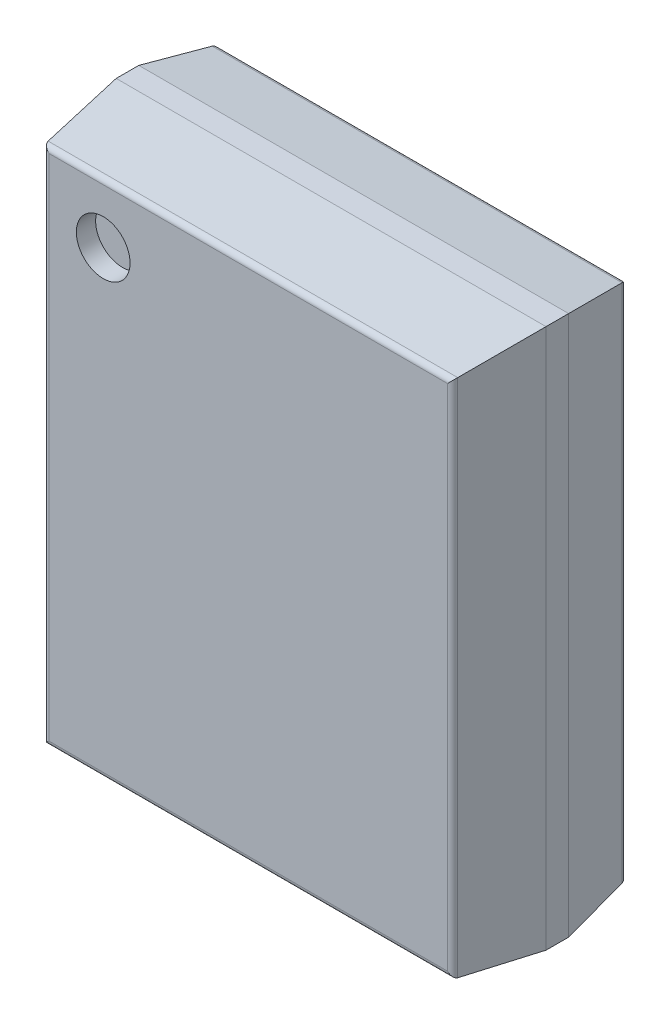
ISO-10303-21;
HEADER;
FILE_DESCRIPTION(('STEP AP214'),'2;1');
FILE_NAME('part.step','',(''),(''),'','','');
FILE_SCHEMA(('AUTOMOTIVE_DESIGN { 1 0 10303 214 1 1 1 1 }'));
ENDSEC;
DATA;
#1=APPLICATION_CONTEXT('core data for automotive mechanical design processes');
#2=APPLICATION_PROTOCOL_DEFINITION('international standard','automotive_design',2000,#1);
#3=PRODUCT_CONTEXT('',#1,'mechanical');
#4=PRODUCT('Part','Part','',(#3));
#5=PRODUCT_RELATED_PRODUCT_CATEGORY('part','',(#4));
#6=PRODUCT_DEFINITION_FORMATION('','',#4);
#7=PRODUCT_DEFINITION_CONTEXT('part definition',#1,'design');
#8=PRODUCT_DEFINITION('design','',#6,#7);
#9=PRODUCT_DEFINITION_SHAPE('','',#8);
#10=(LENGTH_UNIT() NAMED_UNIT(*) SI_UNIT(.MILLI.,.METRE.));
#11=(NAMED_UNIT(*) PLANE_ANGLE_UNIT() SI_UNIT($,.RADIAN.));
#12=(NAMED_UNIT(*) SI_UNIT($,.STERADIAN.) SOLID_ANGLE_UNIT());
#13=UNCERTAINTY_MEASURE_WITH_UNIT(LENGTH_MEASURE(1.E-05),#10,'distance_accuracy_value','');
#14=(GEOMETRIC_REPRESENTATION_CONTEXT(3) GLOBAL_UNCERTAINTY_ASSIGNED_CONTEXT((#13)) GLOBAL_UNIT_ASSIGNED_CONTEXT((#10,
#11,#12)) REPRESENTATION_CONTEXT('',''));
#15=CARTESIAN_POINT('',(0.,0.,0.));
#16=DIRECTION('',(0.,0.,1.));
#17=DIRECTION('',(1.,0.,0.));
#18=AXIS2_PLACEMENT_3D('',#15,#16,#17);
#19=CARTESIAN_POINT('',(-1.315,1.815,1.575));
#20=DIRECTION('',(0.,0.,1.));
#21=DIRECTION('',(1.,0.,0.));
#22=AXIS2_PLACEMENT_3D('',#19,#20,#21);
#23=PLANE('',#22);
#24=CARTESIAN_POINT('',(-1.315,1.815,1.575));
#25=DIRECTION('',(0.,0.,1.));
#26=DIRECTION('',(1.,0.,0.));
#27=AXIS2_PLACEMENT_3D('',#24,#25,#26);
#28=CIRCLE('',#27,0.24375);
#29=CARTESIAN_POINT('',(-1.07125,1.815,1.575));
#30=VERTEX_POINT('',#29);
#31=EDGE_CURVE('E11',#30,#30,#28,.T.);
#32=ORIENTED_EDGE('',*,*,#31,.T.);
#33=EDGE_LOOP('',(#32));
#34=FACE_BOUND('',#33,.T.);
#35=ADVANCED_FACE('F17',(#34),#23,.T.);
#36=CARTESIAN_POINT('',(-1.315,1.815,1.575));
#37=DIRECTION('',(0.,0.,1.));
#38=DIRECTION('',(1.,0.,0.));
#39=AXIS2_PLACEMENT_3D('',#36,#37,#38);
#40=CYLINDRICAL_SURFACE('',#39,0.24375);
#41=DIRECTION('',(0.,0.,1.));
#42=VECTOR('',#41,1.);
#43=CARTESIAN_POINT('',(-1.07125,1.815,1.575));
#44=LINE('',#43,#42);
#45=CARTESIAN_POINT('',(-1.07125,1.815,1.75));
#46=VERTEX_POINT('',#45);
#47=EDGE_CURVE('E25',#30,#46,#44,.T.);
#48=ORIENTED_EDGE('',*,*,#47,.T.);
#49=CARTESIAN_POINT('',(-1.315,1.815,1.75));
#50=DIRECTION('',(0.,0.,1.));
#51=DIRECTION('',(1.,0.,0.));
#52=AXIS2_PLACEMENT_3D('',#49,#50,#51);
#53=CIRCLE('',#52,0.24375);
#54=EDGE_CURVE('E240',#46,#46,#53,.T.);
#55=ORIENTED_EDGE('',*,*,#54,.T.);
#56=ORIENTED_EDGE('',*,*,#47,.F.);
#57=ORIENTED_EDGE('',*,*,#31,.F.);
#58=EDGE_LOOP('',(#48,#55,#56,#57));
#59=FACE_BOUND('',#58,.T.);
#60=ADVANCED_FACE('F405',(#59),#40,.F.);
#61=CARTESIAN_POINT('',(1.808558552786,-2.3525,1.7));
#62=DIRECTION('',(0.,1.,0.));
#63=DIRECTION('',(0.,0.,1.));
#64=AXIS2_PLACEMENT_3D('',#61,#62,#63);
#65=CYLINDRICAL_SURFACE('',#64,0.05);
#66=CARTESIAN_POINT('',(1.808558552786,-2.308558552786,1.7));
#67=DIRECTION('',(-0.707106781186548,-0.707106781186548,0.));
#68=DIRECTION('',(0.707106781186548,-0.707106781186548,0.));
#69=AXIS2_PLACEMENT_3D('',#66,#67,#68);
#70=ELLIPSE('',#69,0.07071067811865,0.05);
#71=CARTESIAN_POINT('',(1.858144342698,-2.358144342698,1.706422572601));
#72=VERTEX_POINT('',#71);
#73=CARTESIAN_POINT('',(1.808558552786,-2.308558552786,1.75));
#74=VERTEX_POINT('',#73);
#75=EDGE_CURVE('E227',#72,#74,#70,.T.);
#76=ORIENTED_EDGE('',*,*,#75,.F.);
#77=DIRECTION('',(0.,1.,0.));
#78=VECTOR('',#77,1.);
#79=CARTESIAN_POINT('',(1.858144342698,-2.3525,1.706422572601));
#80=LINE('',#79,#78);
#81=CARTESIAN_POINT('',(1.858144342698,2.358144342698,1.706422572601));
#82=VERTEX_POINT('',#81);
#83=EDGE_CURVE('E223',#72,#82,#80,.T.);
#84=ORIENTED_EDGE('',*,*,#83,.T.);
#85=CARTESIAN_POINT('',(1.808558552786,2.308558552786,1.7));
#86=DIRECTION('',(-0.707106781186548,0.707106781186548,0.));
#87=DIRECTION('',(0.707106781186548,0.707106781186548,0.));
#88=AXIS2_PLACEMENT_3D('',#85,#86,#87);
#89=ELLIPSE('',#88,0.07071067811865,0.05);
#90=CARTESIAN_POINT('',(1.808558552786,2.308558552786,1.75));
#91=VERTEX_POINT('',#90);
#92=EDGE_CURVE('E214',#91,#82,#89,.T.);
#93=ORIENTED_EDGE('',*,*,#92,.F.);
#94=DIRECTION('',(0.,1.,0.));
#95=VECTOR('',#94,1.);
#96=CARTESIAN_POINT('',(1.808558552786,-2.3525,1.75));
#97=LINE('',#96,#95);
#98=EDGE_CURVE('E228',#74,#91,#97,.T.);
#99=ORIENTED_EDGE('',*,*,#98,.F.);
#100=EDGE_LOOP('',(#76,#84,#93,#99));
#101=FACE_BOUND('',#100,.T.);
#102=ADVANCED_FACE('F252',(#101),#65,.T.);
#103=CARTESIAN_POINT('',(-1.8525,2.308558552786,1.7));
#104=DIRECTION('',(1.,0.,0.));
#105=DIRECTION('',(0.,0.,1.));
#106=AXIS2_PLACEMENT_3D('',#103,#104,#105);
#107=CYLINDRICAL_SURFACE('',#106,0.05);
#108=DIRECTION('',(1.,0.,0.));
#109=VECTOR('',#108,1.);
#110=CARTESIAN_POINT('',(-1.8525,2.308558552786,1.75));
#111=LINE('',#110,#109);
#112=CARTESIAN_POINT('',(-1.808558552786,2.308558552786,1.75));
#113=VERTEX_POINT('',#112);
#114=EDGE_CURVE('E232',#113,#91,#111,.T.);
#115=ORIENTED_EDGE('',*,*,#114,.T.);
#116=ORIENTED_EDGE('',*,*,#92,.T.);
#117=DIRECTION('',(1.,0.,0.));
#118=VECTOR('',#117,1.);
#119=CARTESIAN_POINT('',(-1.8525,2.358144342698,1.706422572601));
#120=LINE('',#119,#118);
#121=CARTESIAN_POINT('',(-1.858144342698,2.358144342698,1.706422572601));
#122=VERTEX_POINT('',#121);
#123=EDGE_CURVE('E218',#122,#82,#120,.T.);
#124=ORIENTED_EDGE('',*,*,#123,.F.);
#125=CARTESIAN_POINT('',(-1.808558552786,2.308558552786,1.7));
#126=DIRECTION('',(0.707106781186548,0.707106781186548,0.));
#127=DIRECTION('',(-0.707106781186548,0.707106781186548,0.));
#128=AXIS2_PLACEMENT_3D('',#125,#126,#127);
#129=ELLIPSE('',#128,0.07071067811865,0.05);
#130=EDGE_CURVE('E211',#122,#113,#129,.T.);
#131=ORIENTED_EDGE('',*,*,#130,.T.);
#132=EDGE_LOOP('',(#115,#116,#124,#131));
#133=FACE_BOUND('',#132,.T.);
#134=ADVANCED_FACE('F247',(#133),#107,.T.);
#135=CARTESIAN_POINT('',(-1.95,-2.45,1.75));
#136=DIRECTION('',(0.,0.,1.));
#137=DIRECTION('',(1.,0.,0.));
#138=AXIS2_PLACEMENT_3D('',#135,#136,#137);
#139=PLANE('',#138);
#140=ORIENTED_EDGE('',*,*,#54,.F.);
#141=EDGE_LOOP('',(#140));
#142=FACE_BOUND('',#141,.T.);
#143=DIRECTION('',(0.,1.,0.));
#144=VECTOR('',#143,1.);
#145=CARTESIAN_POINT('',(-1.808558552786,-2.3525,1.75));
#146=LINE('',#145,#144);
#147=CARTESIAN_POINT('',(-1.808558552786,-2.308558552786,1.75));
#148=VERTEX_POINT('',#147);
#149=EDGE_CURVE('E207',#148,#113,#146,.T.);
#150=ORIENTED_EDGE('',*,*,#149,.F.);
#151=DIRECTION('',(1.,0.,0.));
#152=VECTOR('',#151,1.);
#153=CARTESIAN_POINT('',(-1.8525,-2.308558552786,1.75));
#154=LINE('',#153,#152);
#155=EDGE_CURVE('E233',#148,#74,#154,.T.);
#156=ORIENTED_EDGE('',*,*,#155,.T.);
#157=ORIENTED_EDGE('',*,*,#98,.T.);
#158=ORIENTED_EDGE('',*,*,#114,.F.);
#159=EDGE_LOOP('',(#150,#156,#157,#158));
#160=FACE_BOUND('',#159,.T.);
#161=ADVANCED_FACE('F274',(#142,#160),#139,.T.);
#162=CARTESIAN_POINT('',(-1.8525,-2.308558552786,1.7));
#163=DIRECTION('',(1.,0.,0.));
#164=DIRECTION('',(0.,-0.991715798237691,0.12845145201896));
#165=AXIS2_PLACEMENT_3D('',#162,#163,#164);
#166=CYLINDRICAL_SURFACE('',#165,0.05);
#167=DIRECTION('',(1.,0.,0.));
#168=VECTOR('',#167,1.);
#169=CARTESIAN_POINT('',(-1.8525,-2.358144342698,1.706422572601));
#170=LINE('',#169,#168);
#171=CARTESIAN_POINT('',(-1.858144342698,-2.358144342698,1.706422572601));
#172=VERTEX_POINT('',#171);
#173=EDGE_CURVE('E199',#172,#72,#170,.T.);
#174=ORIENTED_EDGE('',*,*,#173,.T.);
#175=ORIENTED_EDGE('',*,*,#75,.T.);
#176=ORIENTED_EDGE('',*,*,#155,.F.);
#177=CARTESIAN_POINT('',(-1.808558552786,-2.308558552786,1.7));
#178=DIRECTION('',(-0.707106781186548,0.707106781186548,0.));
#179=DIRECTION('',(0.707106781186548,0.707106781186548,0.));
#180=AXIS2_PLACEMENT_3D('',#177,#178,#179);
#181=ELLIPSE('',#180,0.07071067811865,0.05);
#182=EDGE_CURVE('E203',#172,#148,#181,.T.);
#183=ORIENTED_EDGE('',*,*,#182,.F.);
#184=EDGE_LOOP('',(#174,#175,#176,#183));
#185=FACE_BOUND('',#184,.T.);
#186=ADVANCED_FACE('F391',(#185),#166,.T.);
#187=CARTESIAN_POINT('',(1.90125,-2.45,1.373623210137));
#188=DIRECTION('',(0.991715798237691,0.,0.12845145201896));
#189=DIRECTION('',(0.,-1.,0.));
#190=AXIS2_PLACEMENT_3D('',#187,#188,#189);
#191=PLANE('',#190);
#192=DIRECTION('',(-0.12740467794397,0.12740467794397,0.983634127140771));
#193=VECTOR('',#192,1.);
#194=CARTESIAN_POINT('',(1.870389001332,-2.370389001332,1.611887079072));
#195=LINE('',#194,#193);
#196=CARTESIAN_POINT('',(1.95,-2.45,0.997246420274));
#197=VERTEX_POINT('',#196);
#198=EDGE_CURVE('E195',#197,#72,#195,.T.);
#199=ORIENTED_EDGE('',*,*,#198,.F.);
#200=DIRECTION('',(0.,1.,0.));
#201=VECTOR('',#200,1.);
#202=CARTESIAN_POINT('',(1.95,-2.45,0.997246420274));
#203=LINE('',#202,#201);
#204=CARTESIAN_POINT('',(1.95,2.45,0.997246420274));
#205=VERTEX_POINT('',#204);
#206=EDGE_CURVE('E191',#197,#205,#203,.T.);
#207=ORIENTED_EDGE('',*,*,#206,.T.);
#208=DIRECTION('',(-0.12740467794397,-0.12740467794397,0.983634127140771));
#209=VECTOR('',#208,1.);
#210=CARTESIAN_POINT('',(1.830620719025,2.330620719025,1.91892007257));
#211=LINE('',#210,#209);
#212=EDGE_CURVE('E222',#205,#82,#211,.T.);
#213=ORIENTED_EDGE('',*,*,#212,.T.);
#214=ORIENTED_EDGE('',*,*,#83,.F.);
#215=EDGE_LOOP('',(#199,#207,#213,#214));
#216=FACE_BOUND('',#215,.T.);
#217=ADVANCED_FACE('F254',(#216),#191,.T.);
#218=CARTESIAN_POINT('',(-1.95,2.40125,1.373623210137));
#219=DIRECTION('',(0.,0.991715798237691,0.12845145201896));
#220=DIRECTION('',(1.,0.,0.));
#221=AXIS2_PLACEMENT_3D('',#218,#219,#220);
#222=PLANE('',#221);
#223=ORIENTED_EDGE('',*,*,#123,.T.);
#224=ORIENTED_EDGE('',*,*,#212,.F.);
#225=DIRECTION('',(1.,0.,0.));
#226=VECTOR('',#225,1.);
#227=CARTESIAN_POINT('',(-1.95,2.45,0.997246420274));
#228=LINE('',#227,#226);
#229=CARTESIAN_POINT('',(-1.95,2.45,0.997246420274));
#230=VERTEX_POINT('',#229);
#231=EDGE_CURVE('E186',#230,#205,#228,.T.);
#232=ORIENTED_EDGE('',*,*,#231,.F.);
#233=DIRECTION('',(0.12740467794397,-0.12740467794397,0.983634127140771));
#234=VECTOR('',#233,1.);
#235=CARTESIAN_POINT('',(-1.862273025351,2.362273025351,1.674546873663));
#236=LINE('',#235,#234);
#237=EDGE_CURVE('E181',#230,#122,#236,.T.);
#238=ORIENTED_EDGE('',*,*,#237,.T.);
#239=EDGE_LOOP('',(#223,#224,#232,#238));
#240=FACE_BOUND('',#239,.T.);
#241=ADVANCED_FACE('F260',(#240),#222,.T.);
#242=CARTESIAN_POINT('',(-1.808558552786,-2.3525,1.7));
#243=DIRECTION('',(0.,1.,0.));
#244=DIRECTION('',(-0.991715798237691,0.,0.12845145201896));
#245=AXIS2_PLACEMENT_3D('',#242,#243,#244);
#246=CYLINDRICAL_SURFACE('',#245,0.05);
#247=ORIENTED_EDGE('',*,*,#182,.T.);
#248=ORIENTED_EDGE('',*,*,#149,.T.);
#249=ORIENTED_EDGE('',*,*,#130,.F.);
#250=DIRECTION('',(0.,1.,0.));
#251=VECTOR('',#250,1.);
#252=CARTESIAN_POINT('',(-1.858144342698,-2.3525,1.706422572601));
#253=LINE('',#252,#251);
#254=EDGE_CURVE('E151',#172,#122,#253,.T.);
#255=ORIENTED_EDGE('',*,*,#254,.F.);
#256=EDGE_LOOP('',(#247,#248,#249,#255));
#257=FACE_BOUND('',#256,.T.);
#258=ADVANCED_FACE('F271',(#257),#246,.T.);
#259=CARTESIAN_POINT('',(-1.95,-2.40125,1.373623210137));
#260=DIRECTION('',(0.,0.991715798237691,-0.12845145201896));
#261=DIRECTION('',(-1.,0.,0.));
#262=AXIS2_PLACEMENT_3D('',#259,#260,#261);
#263=PLANE('',#262);
#264=DIRECTION('',(0.12740467794397,0.12740467794397,0.983634127140771));
#265=VECTOR('',#264,1.);
#266=CARTESIAN_POINT('',(-1.902041307658,-2.402041307658,1.367513880164));
#267=LINE('',#266,#265);
#268=CARTESIAN_POINT('',(-1.95,-2.45,0.997246420274));
#269=VERTEX_POINT('',#268);
#270=EDGE_CURVE('E187',#269,#172,#267,.T.);
#271=ORIENTED_EDGE('',*,*,#270,.F.);
#272=DIRECTION('',(1.,0.,0.));
#273=VECTOR('',#272,1.);
#274=CARTESIAN_POINT('',(-1.95,-2.45,0.997246420274));
#275=LINE('',#274,#273);
#276=EDGE_CURVE('E333',#269,#197,#275,.T.);
#277=ORIENTED_EDGE('',*,*,#276,.T.);
#278=ORIENTED_EDGE('',*,*,#198,.T.);
#279=ORIENTED_EDGE('',*,*,#173,.F.);
#280=EDGE_LOOP('',(#271,#277,#278,#279));
#281=FACE_BOUND('',#280,.T.);
#282=ADVANCED_FACE('F388',(#281),#263,.F.);
#283=CARTESIAN_POINT('',(1.95,-2.45,0.175));
#284=DIRECTION('',(1.,0.,0.));
#285=DIRECTION('',(0.,1.,0.));
#286=AXIS2_PLACEMENT_3D('',#283,#284,#285);
#287=PLANE('',#286);
#288=DIRECTION('',(0.,0.,1.));
#289=VECTOR('',#288,1.);
#290=CARTESIAN_POINT('',(1.95,-2.45,0.175));
#291=LINE('',#290,#289);
#292=CARTESIAN_POINT('',(1.95,-2.45,0.792246420274));
#293=VERTEX_POINT('',#292);
#294=EDGE_CURVE('E339',#293,#197,#291,.T.);
#295=ORIENTED_EDGE('',*,*,#294,.F.);
#296=DIRECTION('',(0.,1.,0.));
#297=VECTOR('',#296,1.);
#298=CARTESIAN_POINT('',(1.95,-2.45,0.792246420274));
#299=LINE('',#298,#297);
#300=CARTESIAN_POINT('',(1.95,2.45,0.792246420274));
#301=VERTEX_POINT('',#300);
#302=EDGE_CURVE('E167',#293,#301,#299,.T.);
#303=ORIENTED_EDGE('',*,*,#302,.T.);
#304=DIRECTION('',(0.,0.,1.));
#305=VECTOR('',#304,1.);
#306=CARTESIAN_POINT('',(1.95,2.45,0.175));
#307=LINE('',#306,#305);
#308=EDGE_CURVE('E182',#301,#205,#307,.T.);
#309=ORIENTED_EDGE('',*,*,#308,.T.);
#310=ORIENTED_EDGE('',*,*,#206,.F.);
#311=EDGE_LOOP('',(#295,#303,#309,#310));
#312=FACE_BOUND('',#311,.T.);
#313=ADVANCED_FACE('F421',(#312),#287,.T.);
#314=CARTESIAN_POINT('',(1.809778042507,-2.3525,0.225));
#315=DIRECTION('',(0.,1.,0.));
#316=DIRECTION('',(0.,0.,-1.));
#317=AXIS2_PLACEMENT_3D('',#314,#315,#316);
#318=CYLINDRICAL_SURFACE('',#317,0.05);
#319=DIRECTION('',(0.,1.,0.));
#320=VECTOR('',#319,1.);
#321=CARTESIAN_POINT('',(1.809778042507,-2.3525,0.175));
#322=LINE('',#321,#320);
#323=CARTESIAN_POINT('',(1.809778042507,-2.309778042507,0.175));
#324=VERTEX_POINT('',#323);
#325=CARTESIAN_POINT('',(1.809778042507,2.309778042507,0.175));
#326=VERTEX_POINT('',#325);
#327=EDGE_CURVE('E152',#324,#326,#322,.T.);
#328=ORIENTED_EDGE('',*,*,#327,.T.);
#329=CARTESIAN_POINT('',(1.809778042507,2.309778042507,0.225));
#330=DIRECTION('',(0.707106781186548,-0.707106781186548,0.));
#331=DIRECTION('',(0.707106781186548,0.707106781186548,0.));
#332=AXIS2_PLACEMENT_3D('',#329,#330,#331);
#333=ELLIPSE('',#332,0.07071067811865,0.05);
#334=CARTESIAN_POINT('',(1.859165697143,2.359165697143,0.217198745641));
#335=VERTEX_POINT('',#334);
#336=EDGE_CURVE('E139',#326,#335,#333,.T.);
#337=ORIENTED_EDGE('',*,*,#336,.T.);
#338=DIRECTION('',(0.,1.,0.));
#339=VECTOR('',#338,1.);
#340=CARTESIAN_POINT('',(1.859165697143,-2.3525,0.217198745641));
#341=LINE('',#340,#339);
#342=CARTESIAN_POINT('',(1.859165697143,-2.359165697143,0.217198745641));
#343=VERTEX_POINT('',#342);
#344=EDGE_CURVE('E174',#343,#335,#341,.T.);
#345=ORIENTED_EDGE('',*,*,#344,.F.);
#346=CARTESIAN_POINT('',(1.809778042507,-2.309778042507,0.225));
#347=DIRECTION('',(0.707106781186548,0.707106781186548,0.));
#348=DIRECTION('',(0.707106781186548,-0.707106781186548,0.));
#349=AXIS2_PLACEMENT_3D('',#346,#347,#348);
#350=ELLIPSE('',#349,0.07071067811865,0.05);
#351=EDGE_CURVE('E157',#343,#324,#350,.T.);
#352=ORIENTED_EDGE('',*,*,#351,.T.);
#353=EDGE_LOOP('',(#328,#337,#345,#352));
#354=FACE_BOUND('',#353,.T.);
#355=ADVANCED_FACE('F155',(#354),#318,.T.);
#356=CARTESIAN_POINT('',(-1.95,2.45,0.175));
#357=DIRECTION('',(0.,1.,0.));
#358=DIRECTION('',(1.,0.,0.));
#359=AXIS2_PLACEMENT_3D('',#356,#357,#358);
#360=PLANE('',#359);
#361=ORIENTED_EDGE('',*,*,#308,.F.);
#362=DIRECTION('',(1.,0.,0.));
#363=VECTOR('',#362,1.);
#364=CARTESIAN_POINT('',(-1.95,2.45,0.792246420274));
#365=LINE('',#364,#363);
#366=CARTESIAN_POINT('',(-1.95,2.45,0.792246420274));
#367=VERTEX_POINT('',#366);
#368=EDGE_CURVE('E315',#367,#301,#365,.T.);
#369=ORIENTED_EDGE('',*,*,#368,.F.);
#370=DIRECTION('',(0.,0.,1.));
#371=VECTOR('',#370,1.);
#372=CARTESIAN_POINT('',(-1.95,2.45,0.175));
#373=LINE('',#372,#371);
#374=EDGE_CURVE('E297',#367,#230,#373,.T.);
#375=ORIENTED_EDGE('',*,*,#374,.T.);
#376=ORIENTED_EDGE('',*,*,#231,.T.);
#377=EDGE_LOOP('',(#361,#369,#375,#376));
#378=FACE_BOUND('',#377,.T.);
#379=ADVANCED_FACE('F380',(#378),#360,.T.);
#380=CARTESIAN_POINT('',(-1.90125,-2.45,1.373623210137));
#381=DIRECTION('',(0.991715798237691,0.,-0.12845145201896));
#382=DIRECTION('',(0.,-1.,0.));
#383=AXIS2_PLACEMENT_3D('',#380,#381,#382);
#384=PLANE('',#383);
#385=ORIENTED_EDGE('',*,*,#254,.T.);
#386=ORIENTED_EDGE('',*,*,#237,.F.);
#387=DIRECTION('',(0.,1.,0.));
#388=VECTOR('',#387,1.);
#389=CARTESIAN_POINT('',(-1.95,-2.45,0.997246420274));
#390=LINE('',#389,#388);
#391=EDGE_CURVE('E301',#269,#230,#390,.T.);
#392=ORIENTED_EDGE('',*,*,#391,.F.);
#393=ORIENTED_EDGE('',*,*,#270,.T.);
#394=EDGE_LOOP('',(#385,#386,#392,#393));
#395=FACE_BOUND('',#394,.T.);
#396=ADVANCED_FACE('F269',(#395),#384,.F.);
#397=CARTESIAN_POINT('',(-1.8525,2.309778042507,0.225));
#398=DIRECTION('',(1.,0.,0.));
#399=DIRECTION('',(0.,0.,-1.));
#400=AXIS2_PLACEMENT_3D('',#397,#398,#399);
#401=CYLINDRICAL_SURFACE('',#400,0.05);
#402=CARTESIAN_POINT('',(-1.809778042507,2.309778042507,0.225));
#403=DIRECTION('',(-0.707106781186548,-0.707106781186548,0.));
#404=DIRECTION('',(-0.707106781186548,0.707106781186548,0.));
#405=AXIS2_PLACEMENT_3D('',#402,#403,#404);
#406=ELLIPSE('',#405,0.07071067811865,0.05);
#407=CARTESIAN_POINT('',(-1.859165697143,2.359165697143,0.217198745641));
#408=VERTEX_POINT('',#407);
#409=CARTESIAN_POINT('',(-1.809778042507,2.309778042507,0.175));
#410=VERTEX_POINT('',#409);
#411=EDGE_CURVE('E280',#408,#410,#406,.T.);
#412=ORIENTED_EDGE('',*,*,#411,.F.);
#413=DIRECTION('',(1.,0.,0.));
#414=VECTOR('',#413,1.);
#415=CARTESIAN_POINT('',(-1.8525,2.359165697143,0.217198745641));
#416=LINE('',#415,#414);
#417=EDGE_CURVE('E146',#408,#335,#416,.T.);
#418=ORIENTED_EDGE('',*,*,#417,.T.);
#419=ORIENTED_EDGE('',*,*,#336,.F.);
#420=DIRECTION('',(1.,0.,0.));
#421=VECTOR('',#420,1.);
#422=CARTESIAN_POINT('',(-1.8525,2.309778042507,0.175));
#423=LINE('',#422,#421);
#424=EDGE_CURVE('E144',#410,#326,#423,.T.);
#425=ORIENTED_EDGE('',*,*,#424,.F.);
#426=EDGE_LOOP('',(#412,#418,#419,#425));
#427=FACE_BOUND('',#426,.T.);
#428=ADVANCED_FACE('F142',(#427),#401,.T.);
#429=CARTESIAN_POINT('',(-1.95,-2.45,0.175));
#430=DIRECTION('',(0.,0.,1.));
#431=DIRECTION('',(1.,0.,0.));
#432=AXIS2_PLACEMENT_3D('',#429,#430,#431);
#433=PLANE('',#432);
#434=ORIENTED_EDGE('',*,*,#424,.T.);
#435=ORIENTED_EDGE('',*,*,#327,.F.);
#436=DIRECTION('',(1.,0.,0.));
#437=VECTOR('',#436,1.);
#438=CARTESIAN_POINT('',(-1.8525,-2.309778042507,0.175));
#439=LINE('',#438,#437);
#440=CARTESIAN_POINT('',(-1.809778042507,-2.309778042507,0.175));
#441=VERTEX_POINT('',#440);
#442=EDGE_CURVE('E330',#441,#324,#439,.T.);
#443=ORIENTED_EDGE('',*,*,#442,.F.);
#444=DIRECTION('',(0.,1.,0.));
#445=VECTOR('',#444,1.);
#446=CARTESIAN_POINT('',(-1.809778042507,-2.3525,0.175));
#447=LINE('',#446,#445);
#448=EDGE_CURVE('E164',#441,#410,#447,.T.);
#449=ORIENTED_EDGE('',*,*,#448,.T.);
#450=EDGE_LOOP('',(#434,#435,#443,#449));
#451=FACE_BOUND('',#450,.T.);
#452=ADVANCED_FACE('F162',(#451),#433,.F.);
#453=CARTESIAN_POINT('',(1.90125,-2.45,0.483623210137));
#454=DIRECTION('',(-0.987753092714965,0.,0.156025087187994));
#455=DIRECTION('',(0.,1.,0.));
#456=AXIS2_PLACEMENT_3D('',#453,#454,#455);
#457=PLANE('',#456);
#458=ORIENTED_EDGE('',*,*,#344,.T.);
#459=DIRECTION('',(-0.154159948465985,-0.154159948465985,-0.975945398358909));
#460=VECTOR('',#459,1.);
#461=CARTESIAN_POINT('',(1.797841283145,2.297841283145,-0.171029716054));
#462=LINE('',#461,#460);
#463=EDGE_CURVE('E319',#301,#335,#462,.T.);
#464=ORIENTED_EDGE('',*,*,#463,.F.);
#465=ORIENTED_EDGE('',*,*,#302,.F.);
#466=DIRECTION('',(-0.154159948465985,0.154159948465985,-0.975945398358909));
#467=VECTOR('',#466,1.);
#468=CARTESIAN_POINT('',(1.856066242937,-2.356066242937,0.197576930121));
#469=LINE('',#468,#467);
#470=EDGE_CURVE('E296',#293,#343,#469,.T.);
#471=ORIENTED_EDGE('',*,*,#470,.T.);
#472=EDGE_LOOP('',(#458,#464,#465,#471));
#473=FACE_BOUND('',#472,.T.);
#474=ADVANCED_FACE('F347',(#473),#457,.F.);
#475=CARTESIAN_POINT('',(-1.95,-2.45,0.175));
#476=DIRECTION('',(0.,1.,0.));
#477=DIRECTION('',(1.,0.,0.));
#478=AXIS2_PLACEMENT_3D('',#475,#476,#477);
#479=PLANE('',#478);
#480=ORIENTED_EDGE('',*,*,#276,.F.);
#481=DIRECTION('',(0.,0.,1.));
#482=VECTOR('',#481,1.);
#483=CARTESIAN_POINT('',(-1.95,-2.45,0.175));
#484=LINE('',#483,#482);
#485=CARTESIAN_POINT('',(-1.95,-2.45,0.792246420274));
#486=VERTEX_POINT('',#485);
#487=EDGE_CURVE('E300',#486,#269,#484,.T.);
#488=ORIENTED_EDGE('',*,*,#487,.F.);
#489=DIRECTION('',(1.,0.,0.));
#490=VECTOR('',#489,1.);
#491=CARTESIAN_POINT('',(-1.95,-2.45,0.792246420274));
#492=LINE('',#491,#490);
#493=EDGE_CURVE('E307',#486,#293,#492,.T.);
#494=ORIENTED_EDGE('',*,*,#493,.T.);
#495=ORIENTED_EDGE('',*,*,#294,.T.);
#496=EDGE_LOOP('',(#480,#488,#494,#495));
#497=FACE_BOUND('',#496,.T.);
#498=ADVANCED_FACE('F385',(#497),#479,.F.);
#499=CARTESIAN_POINT('',(-1.8525,-2.309778042507,0.225));
#500=DIRECTION('',(1.,0.,0.));
#501=DIRECTION('',(0.,-0.987753092714965,-0.156025087187994));
#502=AXIS2_PLACEMENT_3D('',#499,#500,#501);
#503=CYLINDRICAL_SURFACE('',#502,0.05);
#504=CARTESIAN_POINT('',(-1.809778042507,-2.309778042507,0.225));
#505=DIRECTION('',(0.707106781186548,-0.707106781186548,0.));
#506=DIRECTION('',(0.707106781186548,0.707106781186548,0.));
#507=AXIS2_PLACEMENT_3D('',#504,#505,#506);
#508=ELLIPSE('',#507,0.07071067811865,0.05);
#509=CARTESIAN_POINT('',(-1.859165697143,-2.359165697143,0.217198745641));
#510=VERTEX_POINT('',#509);
#511=EDGE_CURVE('E311',#510,#441,#508,.T.);
#512=ORIENTED_EDGE('',*,*,#511,.T.);
#513=ORIENTED_EDGE('',*,*,#442,.T.);
#514=ORIENTED_EDGE('',*,*,#351,.F.);
#515=DIRECTION('',(1.,0.,0.));
#516=VECTOR('',#515,1.);
#517=CARTESIAN_POINT('',(-1.8525,-2.359165697143,0.217198745641));
#518=LINE('',#517,#516);
#519=EDGE_CURVE('E292',#510,#343,#518,.T.);
#520=ORIENTED_EDGE('',*,*,#519,.F.);
#521=EDGE_LOOP('',(#512,#513,#514,#520));
#522=FACE_BOUND('',#521,.T.);
#523=ADVANCED_FACE('F351',(#522),#503,.T.);
#524=CARTESIAN_POINT('',(-1.95,2.40125,0.483623210137));
#525=DIRECTION('',(0.,-0.987753092714965,0.156025087187994));
#526=DIRECTION('',(-1.,0.,0.));
#527=AXIS2_PLACEMENT_3D('',#524,#525,#526);
#528=PLANE('',#527);
#529=DIRECTION('',(0.154159948465985,-0.154159948465985,-0.975945398358909));
#530=VECTOR('',#529,1.);
#531=CARTESIAN_POINT('',(-1.844183598082,2.344183598082,0.122351083963));
#532=LINE('',#531,#530);
#533=EDGE_CURVE('E283',#367,#408,#532,.T.);
#534=ORIENTED_EDGE('',*,*,#533,.F.);
#535=ORIENTED_EDGE('',*,*,#368,.T.);
#536=ORIENTED_EDGE('',*,*,#463,.T.);
#537=ORIENTED_EDGE('',*,*,#417,.F.);
#538=EDGE_LOOP('',(#534,#535,#536,#537));
#539=FACE_BOUND('',#538,.T.);
#540=ADVANCED_FACE('F377',(#539),#528,.F.);
#541=CARTESIAN_POINT('',(-1.95,-2.45,0.175));
#542=DIRECTION('',(1.,0.,0.));
#543=DIRECTION('',(0.,1.,0.));
#544=AXIS2_PLACEMENT_3D('',#541,#542,#543);
#545=PLANE('',#544);
#546=ORIENTED_EDGE('',*,*,#391,.T.);
#547=ORIENTED_EDGE('',*,*,#374,.F.);
#548=DIRECTION('',(0.,1.,0.));
#549=VECTOR('',#548,1.);
#550=CARTESIAN_POINT('',(-1.95,-2.45,0.792246420274));
#551=LINE('',#550,#549);
#552=EDGE_CURVE('E288',#486,#367,#551,.T.);
#553=ORIENTED_EDGE('',*,*,#552,.F.);
#554=ORIENTED_EDGE('',*,*,#487,.T.);
#555=EDGE_LOOP('',(#546,#547,#553,#554));
#556=FACE_BOUND('',#555,.T.);
#557=ADVANCED_FACE('F382',(#556),#545,.F.);
#558=CARTESIAN_POINT('',(-1.809778042507,-2.3525,0.225));
#559=DIRECTION('',(0.,1.,0.));
#560=DIRECTION('',(-0.987753092714965,0.,-0.156025087187994));
#561=AXIS2_PLACEMENT_3D('',#558,#559,#560);
#562=CYLINDRICAL_SURFACE('',#561,0.05);
#563=DIRECTION('',(0.,1.,0.));
#564=VECTOR('',#563,1.);
#565=CARTESIAN_POINT('',(-1.859165697143,-2.3525,0.217198745641));
#566=LINE('',#565,#564);
#567=EDGE_CURVE('E287',#510,#408,#566,.T.);
#568=ORIENTED_EDGE('',*,*,#567,.T.);
#569=ORIENTED_EDGE('',*,*,#411,.T.);
#570=ORIENTED_EDGE('',*,*,#448,.F.);
#571=ORIENTED_EDGE('',*,*,#511,.F.);
#572=EDGE_LOOP('',(#568,#569,#570,#571));
#573=FACE_BOUND('',#572,.T.);
#574=ADVANCED_FACE('F354',(#573),#562,.T.);
#575=CARTESIAN_POINT('',(-1.95,-2.40125,0.483623210137));
#576=DIRECTION('',(0.,-0.987753092714965,-0.156025087187994));
#577=DIRECTION('',(0.,0.156025087187994,-0.987753092714965));
#578=AXIS2_PLACEMENT_3D('',#575,#576,#577);
#579=PLANE('',#578);
#580=ORIENTED_EDGE('',*,*,#519,.T.);
#581=ORIENTED_EDGE('',*,*,#470,.F.);
#582=ORIENTED_EDGE('',*,*,#493,.F.);
#583=DIRECTION('',(0.154159948465985,0.154159948465985,-0.975945398358909));
#584=VECTOR('',#583,1.);
#585=CARTESIAN_POINT('',(-1.902408557873,-2.402408557873,0.490957730138));
#586=LINE('',#585,#584);
#587=EDGE_CURVE('E363',#486,#510,#586,.T.);
#588=ORIENTED_EDGE('',*,*,#587,.T.);
#589=EDGE_LOOP('',(#580,#581,#582,#588));
#590=FACE_BOUND('',#589,.T.);
#591=ADVANCED_FACE('F371',(#590),#579,.T.);
#592=CARTESIAN_POINT('',(-1.90125,-2.45,0.483623210137));
#593=DIRECTION('',(-0.987753092714965,0.,-0.156025087187994));
#594=DIRECTION('',(-0.156025087187994,0.,0.987753092714965));
#595=AXIS2_PLACEMENT_3D('',#592,#593,#594);
#596=PLANE('',#595);
#597=ORIENTED_EDGE('',*,*,#587,.F.);
#598=ORIENTED_EDGE('',*,*,#552,.T.);
#599=ORIENTED_EDGE('',*,*,#533,.T.);
#600=ORIENTED_EDGE('',*,*,#567,.F.);
#601=EDGE_LOOP('',(#597,#598,#599,#600));
#602=FACE_BOUND('',#601,.T.);
#603=ADVANCED_FACE('F374',(#602),#596,.T.);
#604=CLOSED_SHELL('',(#35,#60,#102,#134,#161,#186,#217,#241,#258,#282,#313,#355,#379,#396,#428,
#452,#474,#498,#523,#540,#557,#574,#591,#603));
#605=MANIFOLD_SOLID_BREP('B1',#604);
#606=ADVANCED_BREP_SHAPE_REPRESENTATION('',(#18,#605),#14);
#607=SHAPE_DEFINITION_REPRESENTATION(#9,#606);
ENDSEC;
END-ISO-10303-21;
